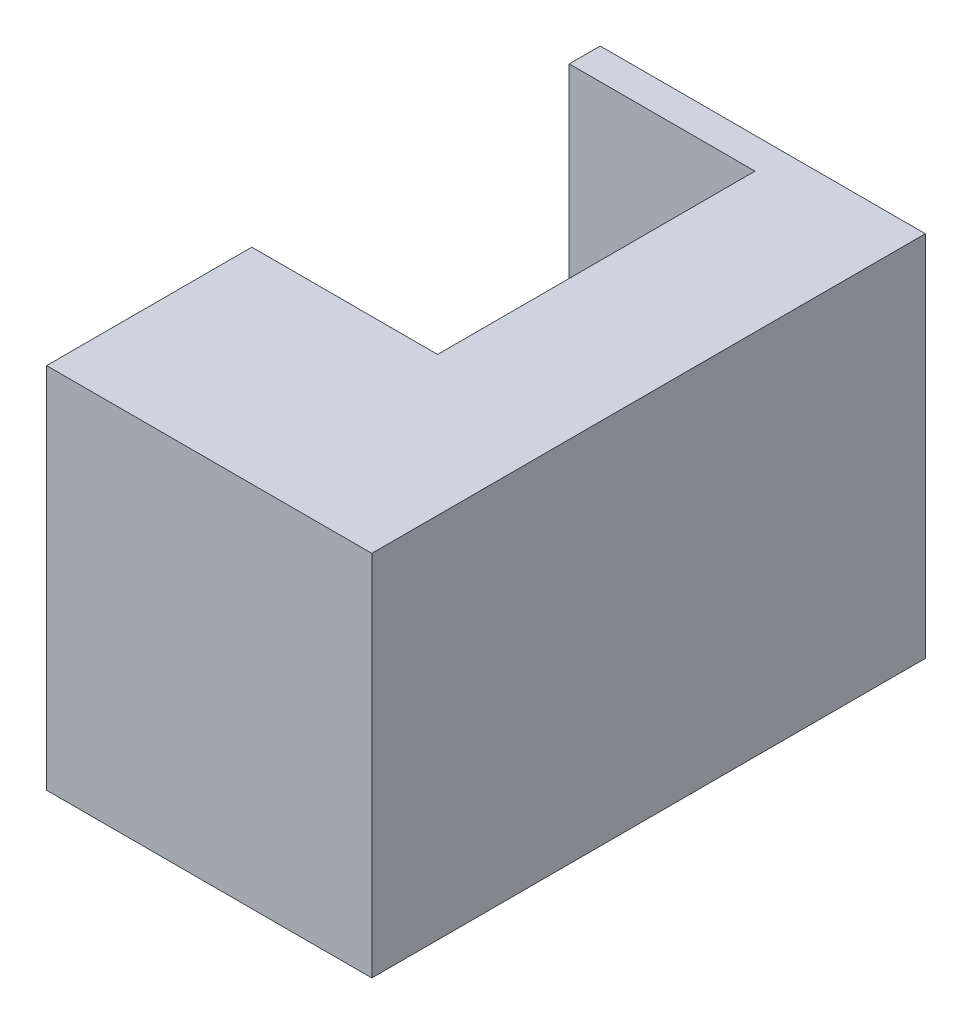
ISO-10303-21;
HEADER;
FILE_DESCRIPTION(('STEP AP214'),'2;1');
FILE_NAME('part.step','',(''),(''),'','','');
FILE_SCHEMA(('AUTOMOTIVE_DESIGN { 1 0 10303 214 1 1 1 1 }'));
ENDSEC;
DATA;
#1=APPLICATION_CONTEXT('core data for automotive mechanical design processes');
#2=APPLICATION_PROTOCOL_DEFINITION('international standard','automotive_design',2000,#1);
#3=PRODUCT_CONTEXT('',#1,'mechanical');
#4=PRODUCT('Part','Part','',(#3));
#5=PRODUCT_RELATED_PRODUCT_CATEGORY('part','',(#4));
#6=PRODUCT_DEFINITION_FORMATION('','',#4);
#7=PRODUCT_DEFINITION_CONTEXT('part definition',#1,'design');
#8=PRODUCT_DEFINITION('design','',#6,#7);
#9=PRODUCT_DEFINITION_SHAPE('','',#8);
#10=(LENGTH_UNIT() NAMED_UNIT(*) SI_UNIT(.MILLI.,.METRE.));
#11=(NAMED_UNIT(*) PLANE_ANGLE_UNIT() SI_UNIT($,.RADIAN.));
#12=(NAMED_UNIT(*) SI_UNIT($,.STERADIAN.) SOLID_ANGLE_UNIT());
#13=UNCERTAINTY_MEASURE_WITH_UNIT(LENGTH_MEASURE(1.E-05),#10,'distance_accuracy_value','');
#14=(GEOMETRIC_REPRESENTATION_CONTEXT(3) GLOBAL_UNCERTAINTY_ASSIGNED_CONTEXT((#13)) GLOBAL_UNIT_ASSIGNED_CONTEXT((#10,
#11,#12)) REPRESENTATION_CONTEXT('',''));
#15=CARTESIAN_POINT('',(0.,0.,0.));
#16=DIRECTION('',(0.,0.,1.));
#17=DIRECTION('',(1.,0.,0.));
#18=AXIS2_PLACEMENT_3D('',#15,#16,#17);
#19=CARTESIAN_POINT('',(19.,9.875,-17.875));
#20=DIRECTION('',(0.,0.,1.));
#21=DIRECTION('',(1.,0.,0.));
#22=AXIS2_PLACEMENT_3D('',#19,#20,#21);
#23=PLANE('',#22);
#24=DIRECTION('',(0.,1.,0.));
#25=VECTOR('',#24,1.);
#26=CARTESIAN_POINT('',(0.,9.875,-17.875));
#27=LINE('',#26,#25);
#28=CARTESIAN_POINT('',(0.,-11.875,-17.875));
#29=VERTEX_POINT('',#28);
#30=CARTESIAN_POINT('',(0.,11.875,-17.875));
#31=VERTEX_POINT('',#30);
#32=EDGE_CURVE('E145',#29,#31,#27,.T.);
#33=ORIENTED_EDGE('',*,*,#32,.T.);
#34=DIRECTION('',(-1.,0.,0.));
#35=VECTOR('',#34,1.);
#36=CARTESIAN_POINT('',(19.,11.875,-17.875));
#37=LINE('',#36,#35);
#38=CARTESIAN_POINT('',(21.,11.875,-17.875));
#39=VERTEX_POINT('',#38);
#40=EDGE_CURVE('E11',#39,#31,#37,.T.);
#41=ORIENTED_EDGE('',*,*,#40,.F.);
#42=DIRECTION('',(0.,1.,0.));
#43=VECTOR('',#42,1.);
#44=CARTESIAN_POINT('',(21.,9.875,-17.875));
#45=LINE('',#44,#43);
#46=CARTESIAN_POINT('',(21.,-11.875,-17.875));
#47=VERTEX_POINT('',#46);
#48=EDGE_CURVE('E120',#47,#39,#45,.T.);
#49=ORIENTED_EDGE('',*,*,#48,.F.);
#50=DIRECTION('',(-1.,0.,0.));
#51=VECTOR('',#50,1.);
#52=CARTESIAN_POINT('',(19.,-11.875,-17.875));
#53=LINE('',#52,#51);
#54=EDGE_CURVE('E141',#47,#29,#53,.T.);
#55=ORIENTED_EDGE('',*,*,#54,.T.);
#56=EDGE_LOOP('',(#33,#41,#49,#55));
#57=FACE_BOUND('',#56,.T.);
#58=ADVANCED_FACE('F43',(#57),#23,.F.);
#59=CARTESIAN_POINT('',(19.,11.875,15.875));
#60=DIRECTION('',(0.,-1.,0.));
#61=DIRECTION('',(0.,0.,-1.));
#62=AXIS2_PLACEMENT_3D('',#59,#60,#61);
#63=PLANE('',#62);
#64=DIRECTION('',(0.,0.,-1.));
#65=VECTOR('',#64,1.);
#66=CARTESIAN_POINT('',(12.,11.875,-15.875));
#67=LINE('',#66,#65);
#68=CARTESIAN_POINT('',(12.,11.875,4.625));
#69=VERTEX_POINT('',#68);
#70=CARTESIAN_POINT('',(12.,11.875,-15.875));
#71=VERTEX_POINT('',#70);
#72=EDGE_CURVE('E220',#69,#71,#67,.T.);
#73=ORIENTED_EDGE('',*,*,#72,.F.);
#74=DIRECTION('',(1.,0.,0.));
#75=VECTOR('',#74,1.);
#76=CARTESIAN_POINT('',(12.,11.875,4.625));
#77=LINE('',#76,#75);
#78=CARTESIAN_POINT('',(0.,11.875,4.625));
#79=VERTEX_POINT('',#78);
#80=EDGE_CURVE('E224',#79,#69,#77,.T.);
#81=ORIENTED_EDGE('',*,*,#80,.F.);
#82=DIRECTION('',(0.,0.,1.));
#83=VECTOR('',#82,1.);
#84=CARTESIAN_POINT('',(0.,11.875,15.875));
#85=LINE('',#84,#83);
#86=CARTESIAN_POINT('',(0.,11.875,17.875));
#87=VERTEX_POINT('',#86);
#88=EDGE_CURVE('E130',#79,#87,#85,.T.);
#89=ORIENTED_EDGE('',*,*,#88,.T.);
#90=DIRECTION('',(-1.,0.,0.));
#91=VECTOR('',#90,1.);
#92=CARTESIAN_POINT('',(19.,11.875,17.875));
#93=LINE('',#92,#91);
#94=CARTESIAN_POINT('',(21.,11.875,17.875));
#95=VERTEX_POINT('',#94);
#96=EDGE_CURVE('E53',#95,#87,#93,.T.);
#97=ORIENTED_EDGE('',*,*,#96,.F.);
#98=DIRECTION('',(0.,0.,1.));
#99=VECTOR('',#98,1.);
#100=CARTESIAN_POINT('',(21.,11.875,15.875));
#101=LINE('',#100,#99);
#102=EDGE_CURVE('E114',#39,#95,#101,.T.);
#103=ORIENTED_EDGE('',*,*,#102,.F.);
#104=ORIENTED_EDGE('',*,*,#40,.T.);
#105=CARTESIAN_POINT('',(0.,11.875,-15.875));
#106=VERTEX_POINT('',#105);
#107=EDGE_CURVE('E47',#31,#106,#85,.T.);
#108=ORIENTED_EDGE('',*,*,#107,.T.);
#109=DIRECTION('',(-1.,0.,0.));
#110=VECTOR('',#109,1.);
#111=CARTESIAN_POINT('',(0.,11.875,-15.875));
#112=LINE('',#111,#110);
#113=EDGE_CURVE('E216',#71,#106,#112,.T.);
#114=ORIENTED_EDGE('',*,*,#113,.F.);
#115=EDGE_LOOP('',(#73,#81,#89,#97,#103,#104,#108,#114));
#116=FACE_BOUND('',#115,.T.);
#117=ADVANCED_FACE('F127',(#116),#63,.F.);
#118=CARTESIAN_POINT('',(19.,9.875,17.875));
#119=DIRECTION('',(0.,0.,-1.));
#120=DIRECTION('',(0.,1.,0.));
#121=AXIS2_PLACEMENT_3D('',#118,#119,#120);
#122=PLANE('',#121);
#123=DIRECTION('',(0.,-1.,0.));
#124=VECTOR('',#123,1.);
#125=CARTESIAN_POINT('',(0.,9.875,17.875));
#126=LINE('',#125,#124);
#127=CARTESIAN_POINT('',(0.,-11.875,17.875));
#128=VERTEX_POINT('',#127);
#129=EDGE_CURVE('E152',#87,#128,#126,.T.);
#130=ORIENTED_EDGE('',*,*,#129,.T.);
#131=DIRECTION('',(-1.,0.,0.));
#132=VECTOR('',#131,1.);
#133=CARTESIAN_POINT('',(19.,-11.875,17.875));
#134=LINE('',#133,#132);
#135=CARTESIAN_POINT('',(21.,-11.875,17.875));
#136=VERTEX_POINT('',#135);
#137=EDGE_CURVE('E134',#136,#128,#134,.T.);
#138=ORIENTED_EDGE('',*,*,#137,.F.);
#139=DIRECTION('',(0.,-1.,0.));
#140=VECTOR('',#139,1.);
#141=CARTESIAN_POINT('',(21.,9.875,17.875));
#142=LINE('',#141,#140);
#143=EDGE_CURVE('E117',#95,#136,#142,.T.);
#144=ORIENTED_EDGE('',*,*,#143,.F.);
#145=ORIENTED_EDGE('',*,*,#96,.T.);
#146=EDGE_LOOP('',(#130,#138,#144,#145));
#147=FACE_BOUND('',#146,.T.);
#148=ADVANCED_FACE('F136',(#147),#122,.F.);
#149=CARTESIAN_POINT('',(19.,-11.875,15.875));
#150=DIRECTION('',(0.,1.,0.));
#151=DIRECTION('',(0.,0.,1.));
#152=AXIS2_PLACEMENT_3D('',#149,#150,#151);
#153=PLANE('',#152);
#154=DIRECTION('',(0.,0.,-1.));
#155=VECTOR('',#154,1.);
#156=CARTESIAN_POINT('',(0.,-11.875,15.875));
#157=LINE('',#156,#155);
#158=EDGE_CURVE('E150',#128,#29,#157,.T.);
#159=ORIENTED_EDGE('',*,*,#158,.T.);
#160=ORIENTED_EDGE('',*,*,#54,.F.);
#161=DIRECTION('',(0.,0.,-1.));
#162=VECTOR('',#161,1.);
#163=CARTESIAN_POINT('',(21.,-11.875,15.875));
#164=LINE('',#163,#162);
#165=EDGE_CURVE('E70',#136,#47,#164,.T.);
#166=ORIENTED_EDGE('',*,*,#165,.F.);
#167=ORIENTED_EDGE('',*,*,#137,.T.);
#168=EDGE_LOOP('',(#159,#160,#166,#167));
#169=FACE_BOUND('',#168,.T.);
#170=ADVANCED_FACE('F240',(#169),#153,.F.);
#171=CARTESIAN_POINT('',(21.,0.,0.));
#172=DIRECTION('',(1.,0.,0.));
#173=DIRECTION('',(0.,0.,-1.));
#174=AXIS2_PLACEMENT_3D('',#171,#172,#173);
#175=PLANE('',#174);
#176=ORIENTED_EDGE('',*,*,#48,.T.);
#177=ORIENTED_EDGE('',*,*,#102,.T.);
#178=ORIENTED_EDGE('',*,*,#143,.T.);
#179=ORIENTED_EDGE('',*,*,#165,.T.);
#180=EDGE_LOOP('',(#176,#177,#178,#179));
#181=FACE_BOUND('',#180,.T.);
#182=ADVANCED_FACE('F45',(#181),#175,.T.);
#183=CARTESIAN_POINT('',(0.,0.,0.));
#184=DIRECTION('',(1.,0.,0.));
#185=DIRECTION('',(0.,0.,-1.));
#186=AXIS2_PLACEMENT_3D('',#183,#184,#185);
#187=PLANE('',#186);
#188=ORIENTED_EDGE('',*,*,#88,.F.);
#189=DIRECTION('',(0.,1.,0.));
#190=VECTOR('',#189,1.);
#191=CARTESIAN_POINT('',(0.,-13.8789470404394,4.625));
#192=LINE('',#191,#190);
#193=CARTESIAN_POINT('',(0.,9.875,4.625));
#194=VERTEX_POINT('',#193);
#195=EDGE_CURVE('E196',#194,#79,#192,.T.);
#196=ORIENTED_EDGE('',*,*,#195,.F.);
#197=DIRECTION('',(0.,0.,1.));
#198=VECTOR('',#197,1.);
#199=CARTESIAN_POINT('',(0.,9.875,15.875));
#200=LINE('',#199,#198);
#201=CARTESIAN_POINT('',(0.,9.875,15.875));
#202=VERTEX_POINT('',#201);
#203=EDGE_CURVE('E61',#194,#202,#200,.T.);
#204=ORIENTED_EDGE('',*,*,#203,.T.);
#205=DIRECTION('',(0.,-1.,0.));
#206=VECTOR('',#205,1.);
#207=CARTESIAN_POINT('',(0.,9.875,15.875));
#208=LINE('',#207,#206);
#209=CARTESIAN_POINT('',(0.,-9.875,15.875));
#210=VERTEX_POINT('',#209);
#211=EDGE_CURVE('E188',#202,#210,#208,.T.);
#212=ORIENTED_EDGE('',*,*,#211,.T.);
#213=DIRECTION('',(0.,0.,-1.));
#214=VECTOR('',#213,1.);
#215=CARTESIAN_POINT('',(0.,-9.875,15.875));
#216=LINE('',#215,#214);
#217=CARTESIAN_POINT('',(0.,-9.875,-15.875));
#218=VERTEX_POINT('',#217);
#219=EDGE_CURVE('E184',#210,#218,#216,.T.);
#220=ORIENTED_EDGE('',*,*,#219,.T.);
#221=DIRECTION('',(0.,1.,0.));
#222=VECTOR('',#221,1.);
#223=CARTESIAN_POINT('',(0.,9.875,-15.875));
#224=LINE('',#223,#222);
#225=EDGE_CURVE('E193',#218,#106,#224,.T.);
#226=ORIENTED_EDGE('',*,*,#225,.T.);
#227=ORIENTED_EDGE('',*,*,#107,.F.);
#228=ORIENTED_EDGE('',*,*,#32,.F.);
#229=ORIENTED_EDGE('',*,*,#158,.F.);
#230=ORIENTED_EDGE('',*,*,#129,.F.);
#231=EDGE_LOOP('',(#188,#196,#204,#212,#220,#226,#227,#228,#229,#230));
#232=FACE_BOUND('',#231,.T.);
#233=ADVANCED_FACE('F241',(#232),#187,.F.);
#234=CARTESIAN_POINT('',(19.,9.875,-15.875));
#235=DIRECTION('',(0.,0.,1.));
#236=DIRECTION('',(1.,0.,0.));
#237=AXIS2_PLACEMENT_3D('',#234,#235,#236);
#238=PLANE('',#237);
#239=ORIENTED_EDGE('',*,*,#225,.F.);
#240=DIRECTION('',(-1.,0.,0.));
#241=VECTOR('',#240,1.);
#242=CARTESIAN_POINT('',(19.,-9.875,-15.875));
#243=LINE('',#242,#241);
#244=CARTESIAN_POINT('',(19.,-9.875,-15.875));
#245=VERTEX_POINT('',#244);
#246=EDGE_CURVE('E168',#245,#218,#243,.T.);
#247=ORIENTED_EDGE('',*,*,#246,.F.);
#248=DIRECTION('',(0.,1.,0.));
#249=VECTOR('',#248,1.);
#250=CARTESIAN_POINT('',(19.,9.875,-15.875));
#251=LINE('',#250,#249);
#252=CARTESIAN_POINT('',(19.,9.875,-15.875));
#253=VERTEX_POINT('',#252);
#254=EDGE_CURVE('E180',#245,#253,#251,.T.);
#255=ORIENTED_EDGE('',*,*,#254,.T.);
#256=DIRECTION('',(-1.,0.,0.));
#257=VECTOR('',#256,1.);
#258=CARTESIAN_POINT('',(19.,9.875,-15.875));
#259=LINE('',#258,#257);
#260=CARTESIAN_POINT('',(12.,9.875,-15.875));
#261=VERTEX_POINT('',#260);
#262=EDGE_CURVE('E149',#253,#261,#259,.T.);
#263=ORIENTED_EDGE('',*,*,#262,.T.);
#264=DIRECTION('',(0.,1.,0.));
#265=VECTOR('',#264,1.);
#266=CARTESIAN_POINT('',(12.,-13.8789470404394,-15.875));
#267=LINE('',#266,#265);
#268=EDGE_CURVE('E200',#261,#71,#267,.T.);
#269=ORIENTED_EDGE('',*,*,#268,.T.);
#270=ORIENTED_EDGE('',*,*,#113,.T.);
#271=EDGE_LOOP('',(#239,#247,#255,#263,#269,#270));
#272=FACE_BOUND('',#271,.T.);
#273=ADVANCED_FACE('F259',(#272),#238,.T.);
#274=CARTESIAN_POINT('',(19.,9.875,15.875));
#275=DIRECTION('',(0.,-1.,0.));
#276=DIRECTION('',(0.,0.,-1.));
#277=AXIS2_PLACEMENT_3D('',#274,#275,#276);
#278=PLANE('',#277);
#279=DIRECTION('',(1.,0.,0.));
#280=VECTOR('',#279,1.);
#281=CARTESIAN_POINT('',(12.,9.875,4.625));
#282=LINE('',#281,#280);
#283=CARTESIAN_POINT('',(12.,9.875,4.625));
#284=VERTEX_POINT('',#283);
#285=EDGE_CURVE('E212',#194,#284,#282,.T.);
#286=ORIENTED_EDGE('',*,*,#285,.T.);
#287=DIRECTION('',(0.,0.,-1.));
#288=VECTOR('',#287,1.);
#289=CARTESIAN_POINT('',(12.,9.875,-15.875));
#290=LINE('',#289,#288);
#291=EDGE_CURVE('E204',#284,#261,#290,.T.);
#292=ORIENTED_EDGE('',*,*,#291,.T.);
#293=ORIENTED_EDGE('',*,*,#262,.F.);
#294=DIRECTION('',(0.,0.,1.));
#295=VECTOR('',#294,1.);
#296=CARTESIAN_POINT('',(19.,9.875,15.875));
#297=LINE('',#296,#295);
#298=CARTESIAN_POINT('',(19.,9.875,15.875));
#299=VERTEX_POINT('',#298);
#300=EDGE_CURVE('E176',#253,#299,#297,.T.);
#301=ORIENTED_EDGE('',*,*,#300,.T.);
#302=DIRECTION('',(-1.,0.,0.));
#303=VECTOR('',#302,1.);
#304=CARTESIAN_POINT('',(19.,9.875,15.875));
#305=LINE('',#304,#303);
#306=EDGE_CURVE('E161',#299,#202,#305,.T.);
#307=ORIENTED_EDGE('',*,*,#306,.T.);
#308=ORIENTED_EDGE('',*,*,#203,.F.);
#309=EDGE_LOOP('',(#286,#292,#293,#301,#307,#308));
#310=FACE_BOUND('',#309,.T.);
#311=ADVANCED_FACE('F263',(#310),#278,.T.);
#312=CARTESIAN_POINT('',(19.,9.875,15.875));
#313=DIRECTION('',(0.,0.,-1.));
#314=DIRECTION('',(0.,1.,0.));
#315=AXIS2_PLACEMENT_3D('',#312,#313,#314);
#316=PLANE('',#315);
#317=ORIENTED_EDGE('',*,*,#211,.F.);
#318=ORIENTED_EDGE('',*,*,#306,.F.);
#319=DIRECTION('',(0.,-1.,0.));
#320=VECTOR('',#319,1.);
#321=CARTESIAN_POINT('',(19.,9.875,15.875));
#322=LINE('',#321,#320);
#323=CARTESIAN_POINT('',(19.,-9.875,15.875));
#324=VERTEX_POINT('',#323);
#325=EDGE_CURVE('E173',#299,#324,#322,.T.);
#326=ORIENTED_EDGE('',*,*,#325,.T.);
#327=DIRECTION('',(-1.,0.,0.));
#328=VECTOR('',#327,1.);
#329=CARTESIAN_POINT('',(19.,-9.875,15.875));
#330=LINE('',#329,#328);
#331=EDGE_CURVE('E165',#324,#210,#330,.T.);
#332=ORIENTED_EDGE('',*,*,#331,.T.);
#333=EDGE_LOOP('',(#317,#318,#326,#332));
#334=FACE_BOUND('',#333,.T.);
#335=ADVANCED_FACE('F268',(#334),#316,.T.);
#336=CARTESIAN_POINT('',(19.,-9.875,15.875));
#337=DIRECTION('',(0.,1.,0.));
#338=DIRECTION('',(0.,0.,1.));
#339=AXIS2_PLACEMENT_3D('',#336,#337,#338);
#340=PLANE('',#339);
#341=ORIENTED_EDGE('',*,*,#219,.F.);
#342=ORIENTED_EDGE('',*,*,#331,.F.);
#343=DIRECTION('',(0.,0.,-1.));
#344=VECTOR('',#343,1.);
#345=CARTESIAN_POINT('',(19.,-9.875,15.875));
#346=LINE('',#345,#344);
#347=EDGE_CURVE('E98',#324,#245,#346,.T.);
#348=ORIENTED_EDGE('',*,*,#347,.T.);
#349=ORIENTED_EDGE('',*,*,#246,.T.);
#350=EDGE_LOOP('',(#341,#342,#348,#349));
#351=FACE_BOUND('',#350,.T.);
#352=ADVANCED_FACE('F275',(#351),#340,.T.);
#353=CARTESIAN_POINT('',(19.,0.,0.));
#354=DIRECTION('',(1.,0.,0.));
#355=DIRECTION('',(0.,0.,-1.));
#356=AXIS2_PLACEMENT_3D('',#353,#354,#355);
#357=PLANE('',#356);
#358=ORIENTED_EDGE('',*,*,#254,.F.);
#359=ORIENTED_EDGE('',*,*,#347,.F.);
#360=ORIENTED_EDGE('',*,*,#325,.F.);
#361=ORIENTED_EDGE('',*,*,#300,.F.);
#362=EDGE_LOOP('',(#358,#359,#360,#361));
#363=FACE_BOUND('',#362,.T.);
#364=ADVANCED_FACE('F279',(#363),#357,.F.);
#365=CARTESIAN_POINT('',(12.,-13.8789470404394,4.625));
#366=DIRECTION('',(0.,0.,1.));
#367=DIRECTION('',(1.,0.,0.));
#368=AXIS2_PLACEMENT_3D('',#365,#366,#367);
#369=PLANE('',#368);
#370=ORIENTED_EDGE('',*,*,#195,.T.);
#371=ORIENTED_EDGE('',*,*,#80,.T.);
#372=DIRECTION('',(0.,1.,0.));
#373=VECTOR('',#372,1.);
#374=CARTESIAN_POINT('',(12.,-13.8789470404394,4.625));
#375=LINE('',#374,#373);
#376=EDGE_CURVE('E208',#284,#69,#375,.T.);
#377=ORIENTED_EDGE('',*,*,#376,.F.);
#378=ORIENTED_EDGE('',*,*,#285,.F.);
#379=EDGE_LOOP('',(#370,#371,#377,#378));
#380=FACE_BOUND('',#379,.T.);
#381=ADVANCED_FACE('F282',(#380),#369,.F.);
#382=CARTESIAN_POINT('',(12.,-13.8789470404394,-15.875));
#383=DIRECTION('',(1.,0.,0.));
#384=DIRECTION('',(0.,0.,-1.));
#385=AXIS2_PLACEMENT_3D('',#382,#383,#384);
#386=PLANE('',#385);
#387=ORIENTED_EDGE('',*,*,#376,.T.);
#388=ORIENTED_EDGE('',*,*,#72,.T.);
#389=ORIENTED_EDGE('',*,*,#268,.F.);
#390=ORIENTED_EDGE('',*,*,#291,.F.);
#391=EDGE_LOOP('',(#387,#388,#389,#390));
#392=FACE_BOUND('',#391,.T.);
#393=ADVANCED_FACE('F286',(#392),#386,.F.);
#394=CLOSED_SHELL('',(#58,#117,#148,#170,#182,#233,#273,#311,#335,#352,#364,#381,#393));
#395=MANIFOLD_SOLID_BREP('B2',#394);
#396=ADVANCED_BREP_SHAPE_REPRESENTATION('',(#18,#395),#14);
#397=SHAPE_DEFINITION_REPRESENTATION(#9,#396);
ENDSEC;
END-ISO-10303-21;
